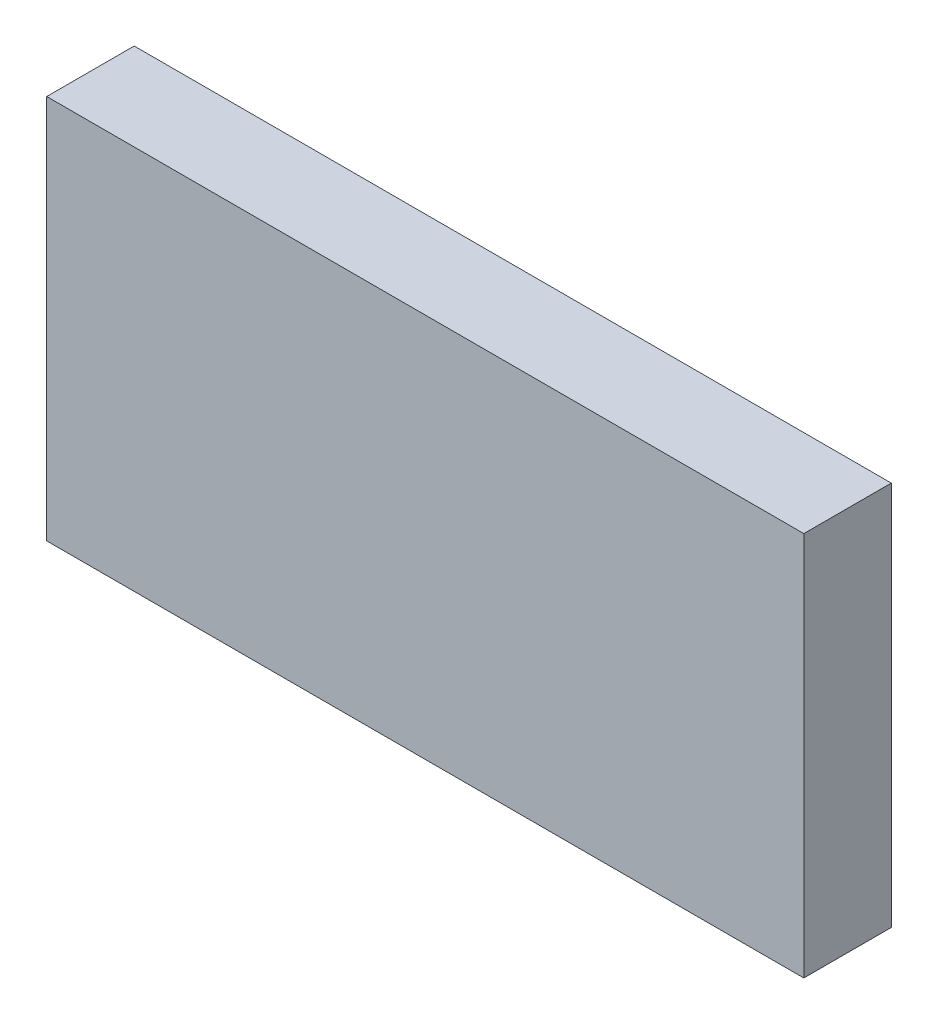
ISO-10303-21;
HEADER;
FILE_DESCRIPTION(('STEP AP214'),'2;1');
FILE_NAME('part.step','',(''),(''),'','','');
FILE_SCHEMA(('AUTOMOTIVE_DESIGN { 1 0 10303 214 1 1 1 1 }'));
ENDSEC;
DATA;
#1=APPLICATION_CONTEXT('core data for automotive mechanical design processes');
#2=APPLICATION_PROTOCOL_DEFINITION('international standard','automotive_design',2000,#1);
#3=PRODUCT_CONTEXT('',#1,'mechanical');
#4=PRODUCT('Part','Part','',(#3));
#5=PRODUCT_RELATED_PRODUCT_CATEGORY('part','',(#4));
#6=PRODUCT_DEFINITION_FORMATION('','',#4);
#7=PRODUCT_DEFINITION_CONTEXT('part definition',#1,'design');
#8=PRODUCT_DEFINITION('design','',#6,#7);
#9=PRODUCT_DEFINITION_SHAPE('','',#8);
#10=(LENGTH_UNIT() NAMED_UNIT(*) SI_UNIT(.MILLI.,.METRE.));
#11=(NAMED_UNIT(*) PLANE_ANGLE_UNIT() SI_UNIT($,.RADIAN.));
#12=(NAMED_UNIT(*) SI_UNIT($,.STERADIAN.) SOLID_ANGLE_UNIT());
#13=UNCERTAINTY_MEASURE_WITH_UNIT(LENGTH_MEASURE(1.E-05),#10,'distance_accuracy_value','');
#14=(GEOMETRIC_REPRESENTATION_CONTEXT(3) GLOBAL_UNCERTAINTY_ASSIGNED_CONTEXT((#13)) GLOBAL_UNIT_ASSIGNED_CONTEXT((#10,
#11,#12)) REPRESENTATION_CONTEXT('',''));
#15=CARTESIAN_POINT('',(0.,0.,0.));
#16=DIRECTION('',(0.,0.,1.));
#17=DIRECTION('',(1.,0.,0.));
#18=AXIS2_PLACEMENT_3D('',#15,#16,#17);
#19=CARTESIAN_POINT('',(0.5795,-1.42,0.));
#20=DIRECTION('',(1.,0.,0.));
#21=DIRECTION('',(0.,0.,1.));
#22=AXIS2_PLACEMENT_3D('',#19,#20,#21);
#23=PLANE('',#22);
#24=DIRECTION('',(0.,1.,0.));
#25=VECTOR('',#24,1.);
#26=CARTESIAN_POINT('',(0.5795,-1.42,0.1));
#27=LINE('',#26,#25);
#28=CARTESIAN_POINT('',(0.5795,-1.42,0.1));
#29=VERTEX_POINT('',#28);
#30=CARTESIAN_POINT('',(0.5795,-0.98,0.1));
#31=VERTEX_POINT('',#30);
#32=EDGE_CURVE('E11',#29,#31,#27,.T.);
#33=ORIENTED_EDGE('',*,*,#32,.T.);
#34=DIRECTION('',(0.,0.,1.));
#35=VECTOR('',#34,1.);
#36=CARTESIAN_POINT('',(0.5795,-0.98,0.));
#37=LINE('',#36,#35);
#38=CARTESIAN_POINT('',(0.5795,-0.98,0.));
#39=VERTEX_POINT('',#38);
#40=EDGE_CURVE('E24',#39,#31,#37,.T.);
#41=ORIENTED_EDGE('',*,*,#40,.F.);
#42=DIRECTION('',(0.,1.,0.));
#43=VECTOR('',#42,1.);
#44=CARTESIAN_POINT('',(0.5795,-1.42,0.));
#45=LINE('',#44,#43);
#46=CARTESIAN_POINT('',(0.5795,-1.42,0.));
#47=VERTEX_POINT('',#46);
#48=EDGE_CURVE('E86',#47,#39,#45,.T.);
#49=ORIENTED_EDGE('',*,*,#48,.F.);
#50=DIRECTION('',(0.,0.,1.));
#51=VECTOR('',#50,1.);
#52=CARTESIAN_POINT('',(0.5795,-1.42,0.));
#53=LINE('',#52,#51);
#54=EDGE_CURVE('E36',#47,#29,#53,.T.);
#55=ORIENTED_EDGE('',*,*,#54,.T.);
#56=EDGE_LOOP('',(#33,#41,#49,#55));
#57=FACE_BOUND('',#56,.T.);
#58=ADVANCED_FACE('F17',(#57),#23,.F.);
#59=CARTESIAN_POINT('',(1.445,-1.42,0.));
#60=DIRECTION('',(1.,0.,0.));
#61=DIRECTION('',(0.,0.,1.));
#62=AXIS2_PLACEMENT_3D('',#59,#60,#61);
#63=PLANE('',#62);
#64=DIRECTION('',(0.,0.,1.));
#65=VECTOR('',#64,1.);
#66=CARTESIAN_POINT('',(1.445,-1.42,0.));
#67=LINE('',#66,#65);
#68=CARTESIAN_POINT('',(1.445,-1.42,0.));
#69=VERTEX_POINT('',#68);
#70=CARTESIAN_POINT('',(1.445,-1.42,0.1));
#71=VERTEX_POINT('',#70);
#72=EDGE_CURVE('E83',#69,#71,#67,.T.);
#73=ORIENTED_EDGE('',*,*,#72,.F.);
#74=DIRECTION('',(0.,1.,0.));
#75=VECTOR('',#74,1.);
#76=CARTESIAN_POINT('',(1.445,-1.42,0.));
#77=LINE('',#76,#75);
#78=CARTESIAN_POINT('',(1.445,-0.98,0.));
#79=VERTEX_POINT('',#78);
#80=EDGE_CURVE('E63',#69,#79,#77,.T.);
#81=ORIENTED_EDGE('',*,*,#80,.T.);
#82=DIRECTION('',(0.,0.,1.));
#83=VECTOR('',#82,1.);
#84=CARTESIAN_POINT('',(1.445,-0.98,0.));
#85=LINE('',#84,#83);
#86=CARTESIAN_POINT('',(1.445,-0.98,0.1));
#87=VERTEX_POINT('',#86);
#88=EDGE_CURVE('E57',#79,#87,#85,.T.);
#89=ORIENTED_EDGE('',*,*,#88,.T.);
#90=DIRECTION('',(0.,1.,0.));
#91=VECTOR('',#90,1.);
#92=CARTESIAN_POINT('',(1.445,-1.42,0.1));
#93=LINE('',#92,#91);
#94=EDGE_CURVE('E60',#71,#87,#93,.T.);
#95=ORIENTED_EDGE('',*,*,#94,.F.);
#96=EDGE_LOOP('',(#73,#81,#89,#95));
#97=FACE_BOUND('',#96,.T.);
#98=ADVANCED_FACE('F59',(#97),#63,.T.);
#99=CARTESIAN_POINT('',(0.5795,-1.42,0.));
#100=DIRECTION('',(0.,1.,0.));
#101=DIRECTION('',(0.,0.,1.));
#102=AXIS2_PLACEMENT_3D('',#99,#100,#101);
#103=PLANE('',#102);
#104=ORIENTED_EDGE('',*,*,#72,.T.);
#105=DIRECTION('',(1.,0.,0.));
#106=VECTOR('',#105,1.);
#107=CARTESIAN_POINT('',(0.5795,-1.42,0.1));
#108=LINE('',#107,#106);
#109=EDGE_CURVE('E71',#29,#71,#108,.T.);
#110=ORIENTED_EDGE('',*,*,#109,.F.);
#111=ORIENTED_EDGE('',*,*,#54,.F.);
#112=DIRECTION('',(1.,0.,0.));
#113=VECTOR('',#112,1.);
#114=CARTESIAN_POINT('',(0.5795,-1.42,0.));
#115=LINE('',#114,#113);
#116=EDGE_CURVE('E76',#47,#69,#115,.T.);
#117=ORIENTED_EDGE('',*,*,#116,.T.);
#118=EDGE_LOOP('',(#104,#110,#111,#117));
#119=FACE_BOUND('',#118,.T.);
#120=ADVANCED_FACE('F91',(#119),#103,.F.);
#121=CARTESIAN_POINT('',(0.5795,-0.98,0.));
#122=DIRECTION('',(0.,1.,0.));
#123=DIRECTION('',(0.,0.,1.));
#124=AXIS2_PLACEMENT_3D('',#121,#122,#123);
#125=PLANE('',#124);
#126=DIRECTION('',(1.,0.,0.));
#127=VECTOR('',#126,1.);
#128=CARTESIAN_POINT('',(0.5795,-0.98,0.));
#129=LINE('',#128,#127);
#130=EDGE_CURVE('E74',#39,#79,#129,.T.);
#131=ORIENTED_EDGE('',*,*,#130,.F.);
#132=ORIENTED_EDGE('',*,*,#40,.T.);
#133=DIRECTION('',(1.,0.,0.));
#134=VECTOR('',#133,1.);
#135=CARTESIAN_POINT('',(0.5795,-0.98,0.1));
#136=LINE('',#135,#134);
#137=EDGE_CURVE('E69',#31,#87,#136,.T.);
#138=ORIENTED_EDGE('',*,*,#137,.T.);
#139=ORIENTED_EDGE('',*,*,#88,.F.);
#140=EDGE_LOOP('',(#131,#132,#138,#139));
#141=FACE_BOUND('',#140,.T.);
#142=ADVANCED_FACE('F73',(#141),#125,.T.);
#143=CARTESIAN_POINT('',(0.5795,-1.42,0.));
#144=DIRECTION('',(0.,0.,1.));
#145=DIRECTION('',(1.,0.,0.));
#146=AXIS2_PLACEMENT_3D('',#143,#144,#145);
#147=PLANE('',#146);
#148=ORIENTED_EDGE('',*,*,#130,.T.);
#149=ORIENTED_EDGE('',*,*,#80,.F.);
#150=ORIENTED_EDGE('',*,*,#116,.F.);
#151=ORIENTED_EDGE('',*,*,#48,.T.);
#152=EDGE_LOOP('',(#148,#149,#150,#151));
#153=FACE_BOUND('',#152,.T.);
#154=ADVANCED_FACE('F89',(#153),#147,.F.);
#155=CARTESIAN_POINT('',(0.5795,-1.42,0.1));
#156=DIRECTION('',(0.,0.,1.));
#157=DIRECTION('',(1.,0.,0.));
#158=AXIS2_PLACEMENT_3D('',#155,#156,#157);
#159=PLANE('',#158);
#160=ORIENTED_EDGE('',*,*,#32,.F.);
#161=ORIENTED_EDGE('',*,*,#109,.T.);
#162=ORIENTED_EDGE('',*,*,#94,.T.);
#163=ORIENTED_EDGE('',*,*,#137,.F.);
#164=EDGE_LOOP('',(#160,#161,#162,#163));
#165=FACE_BOUND('',#164,.T.);
#166=ADVANCED_FACE('F68',(#165),#159,.T.);
#167=CLOSED_SHELL('',(#58,#98,#120,#142,#154,#166));
#168=MANIFOLD_SOLID_BREP('B1',#167);
#169=ADVANCED_BREP_SHAPE_REPRESENTATION('',(#18,#168),#14);
#170=SHAPE_DEFINITION_REPRESENTATION(#9,#169);
ENDSEC;
END-ISO-10303-21;
